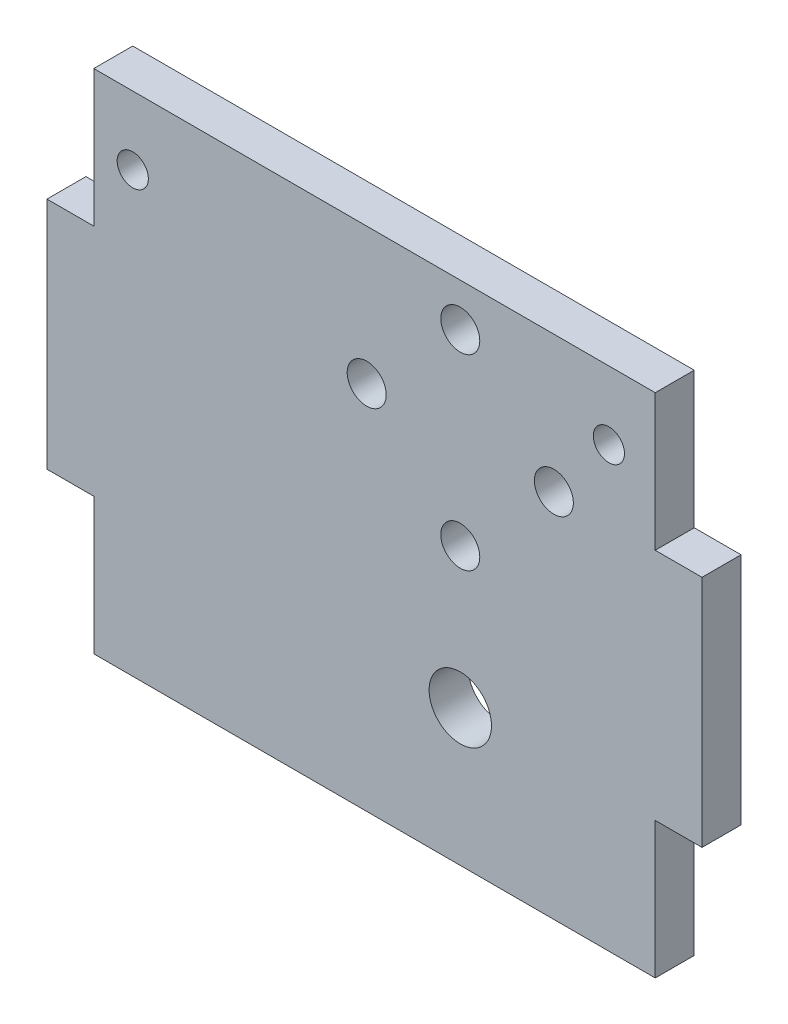
ISO-10303-21;
HEADER;
FILE_DESCRIPTION(('STEP AP214'),'2;1');
FILE_NAME('part.step','',(''),(''),'','','');
FILE_SCHEMA(('AUTOMOTIVE_DESIGN { 1 0 10303 214 1 1 1 1 }'));
ENDSEC;
DATA;
#1=APPLICATION_CONTEXT('core data for automotive mechanical design processes');
#2=APPLICATION_PROTOCOL_DEFINITION('international standard','automotive_design',2000,#1);
#3=PRODUCT_CONTEXT('',#1,'mechanical');
#4=PRODUCT('Part','Part','',(#3));
#5=PRODUCT_RELATED_PRODUCT_CATEGORY('part','',(#4));
#6=PRODUCT_DEFINITION_FORMATION('','',#4);
#7=PRODUCT_DEFINITION_CONTEXT('part definition',#1,'design');
#8=PRODUCT_DEFINITION('design','',#6,#7);
#9=PRODUCT_DEFINITION_SHAPE('','',#8);
#10=(LENGTH_UNIT() NAMED_UNIT(*) SI_UNIT(.MILLI.,.METRE.));
#11=(NAMED_UNIT(*) PLANE_ANGLE_UNIT() SI_UNIT($,.RADIAN.));
#12=(NAMED_UNIT(*) SI_UNIT($,.STERADIAN.) SOLID_ANGLE_UNIT());
#13=UNCERTAINTY_MEASURE_WITH_UNIT(LENGTH_MEASURE(1.E-05),#10,'distance_accuracy_value','');
#14=(GEOMETRIC_REPRESENTATION_CONTEXT(3) GLOBAL_UNCERTAINTY_ASSIGNED_CONTEXT((#13)) GLOBAL_UNIT_ASSIGNED_CONTEXT((#10,
#11,#12)) REPRESENTATION_CONTEXT('',''));
#15=CARTESIAN_POINT('',(0.,0.,0.));
#16=DIRECTION('',(0.,0.,1.));
#17=DIRECTION('',(1.,0.,0.));
#18=AXIS2_PLACEMENT_3D('',#15,#16,#17);
#19=CARTESIAN_POINT('',(50.,0.,5.));
#20=DIRECTION('',(-1.,0.,0.));
#21=DIRECTION('',(0.,0.,1.));
#22=AXIS2_PLACEMENT_3D('',#19,#20,#21);
#23=PLANE('',#22);
#24=DIRECTION('',(0.,0.,1.));
#25=VECTOR('',#24,1.);
#26=CARTESIAN_POINT('',(50.,47.5,-30.5941170815567));
#27=LINE('',#26,#25);
#28=CARTESIAN_POINT('',(50.,47.5,0.));
#29=VERTEX_POINT('',#28);
#30=CARTESIAN_POINT('',(50.,47.5,5.));
#31=VERTEX_POINT('',#30);
#32=EDGE_CURVE('E58',#29,#31,#27,.T.);
#33=ORIENTED_EDGE('',*,*,#32,.F.);
#34=DIRECTION('',(0.,1.,0.));
#35=VECTOR('',#34,1.);
#36=CARTESIAN_POINT('',(50.,0.,0.));
#37=LINE('',#36,#35);
#38=CARTESIAN_POINT('',(50.,65.,0.));
#39=VERTEX_POINT('',#38);
#40=EDGE_CURVE('E216',#29,#39,#37,.T.);
#41=ORIENTED_EDGE('',*,*,#40,.T.);
#42=DIRECTION('',(0.,0.,-1.));
#43=VECTOR('',#42,1.);
#44=CARTESIAN_POINT('',(50.,65.,5.));
#45=LINE('',#44,#43);
#46=CARTESIAN_POINT('',(50.,65.,5.));
#47=VERTEX_POINT('',#46);
#48=EDGE_CURVE('E42',#47,#39,#45,.T.);
#49=ORIENTED_EDGE('',*,*,#48,.F.);
#50=DIRECTION('',(0.,1.,0.));
#51=VECTOR('',#50,1.);
#52=CARTESIAN_POINT('',(50.,0.,5.));
#53=LINE('',#52,#51);
#54=EDGE_CURVE('E209',#31,#47,#53,.T.);
#55=ORIENTED_EDGE('',*,*,#54,.F.);
#56=EDGE_LOOP('',(#33,#41,#49,#55));
#57=FACE_BOUND('',#56,.T.);
#58=ADVANCED_FACE('F33',(#57),#23,.F.);
#59=CARTESIAN_POINT('',(-22.,65.,70.0076918525801));
#60=DIRECTION('',(-1.,0.,0.));
#61=DIRECTION('',(0.,0.,1.));
#62=AXIS2_PLACEMENT_3D('',#59,#60,#61);
#63=PLANE('',#62);
#64=DIRECTION('',(0.,1.,0.));
#65=VECTOR('',#64,1.);
#66=CARTESIAN_POINT('',(-22.,65.,0.));
#67=LINE('',#66,#65);
#68=CARTESIAN_POINT('',(-22.,47.5,0.));
#69=VERTEX_POINT('',#68);
#70=CARTESIAN_POINT('',(-22.,65.,0.));
#71=VERTEX_POINT('',#70);
#72=EDGE_CURVE('E176',#69,#71,#67,.T.);
#73=ORIENTED_EDGE('',*,*,#72,.F.);
#74=DIRECTION('',(0.,0.,1.));
#75=VECTOR('',#74,1.);
#76=CARTESIAN_POINT('',(-22.,47.5,-30.5941170815567));
#77=LINE('',#76,#75);
#78=CARTESIAN_POINT('',(-22.,47.5,5.));
#79=VERTEX_POINT('',#78);
#80=EDGE_CURVE('E172',#69,#79,#77,.T.);
#81=ORIENTED_EDGE('',*,*,#80,.T.);
#82=DIRECTION('',(0.,-1.,0.));
#83=VECTOR('',#82,1.);
#84=CARTESIAN_POINT('',(-22.,65.,5.));
#85=LINE('',#84,#83);
#86=CARTESIAN_POINT('',(-22.,65.,5.));
#87=VERTEX_POINT('',#86);
#88=EDGE_CURVE('E187',#87,#79,#85,.T.);
#89=ORIENTED_EDGE('',*,*,#88,.F.);
#90=DIRECTION('',(0.,0.,-1.));
#91=VECTOR('',#90,1.);
#92=CARTESIAN_POINT('',(-22.,65.,70.0076918525801));
#93=LINE('',#92,#91);
#94=EDGE_CURVE('E196',#87,#71,#93,.T.);
#95=ORIENTED_EDGE('',*,*,#94,.T.);
#96=EDGE_LOOP('',(#73,#81,#89,#95));
#97=FACE_BOUND('',#96,.T.);
#98=ADVANCED_FACE('F279',(#97),#63,.T.);
#99=CARTESIAN_POINT('',(0.,0.,5.));
#100=DIRECTION('',(0.,0.,-1.));
#101=DIRECTION('',(-1.,0.,0.));
#102=AXIS2_PLACEMENT_3D('',#99,#100,#101);
#103=PLANE('',#102);
#104=CARTESIAN_POINT('',(25.,59.5,5.));
#105=DIRECTION('',(0.,0.,1.));
#106=DIRECTION('',(1.,0.,0.));
#107=AXIS2_PLACEMENT_3D('',#104,#105,#106);
#108=CIRCLE('',#107,2.5);
#109=CARTESIAN_POINT('',(27.5,59.5,5.));
#110=VERTEX_POINT('',#109);
#111=EDGE_CURVE('E234',#110,#110,#108,.T.);
#112=ORIENTED_EDGE('',*,*,#111,.F.);
#113=EDGE_LOOP('',(#112));
#114=FACE_BOUND('',#113,.T.);
#115=CARTESIAN_POINT('',(25.,35.5,5.));
#116=DIRECTION('',(0.,0.,1.));
#117=DIRECTION('',(1.,0.,0.));
#118=AXIS2_PLACEMENT_3D('',#115,#116,#117);
#119=CIRCLE('',#118,2.5);
#120=CARTESIAN_POINT('',(27.5,35.5,5.));
#121=VERTEX_POINT('',#120);
#122=EDGE_CURVE('E505',#121,#121,#119,.T.);
#123=ORIENTED_EDGE('',*,*,#122,.F.);
#124=EDGE_LOOP('',(#123));
#125=FACE_BOUND('',#124,.T.);
#126=CARTESIAN_POINT('',(13.,47.5,5.));
#127=DIRECTION('',(0.,0.,1.));
#128=DIRECTION('',(1.,0.,0.));
#129=AXIS2_PLACEMENT_3D('',#126,#127,#128);
#130=CIRCLE('',#129,2.5);
#131=CARTESIAN_POINT('',(15.5,47.5,5.));
#132=VERTEX_POINT('',#131);
#133=EDGE_CURVE('E508',#132,#132,#130,.T.);
#134=ORIENTED_EDGE('',*,*,#133,.F.);
#135=EDGE_LOOP('',(#134));
#136=FACE_BOUND('',#135,.T.);
#137=CARTESIAN_POINT('',(37.,47.5,5.));
#138=DIRECTION('',(0.,0.,1.));
#139=DIRECTION('',(1.,0.,0.));
#140=AXIS2_PLACEMENT_3D('',#137,#138,#139);
#141=CIRCLE('',#140,2.5);
#142=CARTESIAN_POINT('',(39.5,47.5,5.));
#143=VERTEX_POINT('',#142);
#144=EDGE_CURVE('E512',#143,#143,#141,.T.);
#145=ORIENTED_EDGE('',*,*,#144,.F.);
#146=EDGE_LOOP('',(#145));
#147=FACE_BOUND('',#146,.T.);
#148=CARTESIAN_POINT('',(-17.,56.25,5.));
#149=DIRECTION('',(0.,0.,1.));
#150=DIRECTION('',(1.,0.,0.));
#151=AXIS2_PLACEMENT_3D('',#148,#149,#150);
#152=CIRCLE('',#151,2.);
#153=CARTESIAN_POINT('',(-15.,56.25,5.));
#154=VERTEX_POINT('',#153);
#155=EDGE_CURVE('E227',#154,#154,#152,.T.);
#156=ORIENTED_EDGE('',*,*,#155,.F.);
#157=EDGE_LOOP('',(#156));
#158=FACE_BOUND('',#157,.T.);
#159=CARTESIAN_POINT('',(44.0556394164773,56.25,5.));
#160=DIRECTION('',(0.,0.,1.));
#161=DIRECTION('',(1.,0.,0.));
#162=AXIS2_PLACEMENT_3D('',#159,#160,#161);
#163=CIRCLE('',#162,2.);
#164=CARTESIAN_POINT('',(46.0556394164773,56.25,5.));
#165=VERTEX_POINT('',#164);
#166=EDGE_CURVE('E241',#165,#165,#163,.T.);
#167=ORIENTED_EDGE('',*,*,#166,.F.);
#168=EDGE_LOOP('',(#167));
#169=FACE_BOUND('',#168,.T.);
#170=DIRECTION('',(-1.,0.,0.));
#171=VECTOR('',#170,1.);
#172=CARTESIAN_POINT('',(0.,65.,5.));
#173=LINE('',#172,#171);
#174=EDGE_CURVE('E213',#47,#87,#173,.T.);
#175=ORIENTED_EDGE('',*,*,#174,.T.);
#176=ORIENTED_EDGE('',*,*,#88,.T.);
#177=DIRECTION('',(1.,0.,0.));
#178=VECTOR('',#177,1.);
#179=CARTESIAN_POINT('',(0.,47.5,5.));
#180=LINE('',#179,#178);
#181=CARTESIAN_POINT('',(-28.,47.5,5.));
#182=VERTEX_POINT('',#181);
#183=EDGE_CURVE('E169',#182,#79,#180,.T.);
#184=ORIENTED_EDGE('',*,*,#183,.F.);
#185=DIRECTION('',(0.,1.,0.));
#186=VECTOR('',#185,1.);
#187=CARTESIAN_POINT('',(-28.,0.,5.));
#188=LINE('',#187,#186);
#189=CARTESIAN_POINT('',(-28.,17.5,5.));
#190=VERTEX_POINT('',#189);
#191=EDGE_CURVE('E165',#190,#182,#188,.T.);
#192=ORIENTED_EDGE('',*,*,#191,.F.);
#193=DIRECTION('',(-1.,0.,0.));
#194=VECTOR('',#193,1.);
#195=CARTESIAN_POINT('',(0.,17.5,5.));
#196=LINE('',#195,#194);
#197=CARTESIAN_POINT('',(-22.,17.5,5.));
#198=VERTEX_POINT('',#197);
#199=EDGE_CURVE('E160',#198,#190,#196,.T.);
#200=ORIENTED_EDGE('',*,*,#199,.F.);
#201=CARTESIAN_POINT('',(-22.,0.,5.));
#202=VERTEX_POINT('',#201);
#203=EDGE_CURVE('E191',#198,#202,#85,.T.);
#204=ORIENTED_EDGE('',*,*,#203,.T.);
#205=DIRECTION('',(1.,0.,0.));
#206=VECTOR('',#205,1.);
#207=CARTESIAN_POINT('',(0.,0.,5.));
#208=LINE('',#207,#206);
#209=CARTESIAN_POINT('',(50.,0.,5.));
#210=VERTEX_POINT('',#209);
#211=EDGE_CURVE('E207',#202,#210,#208,.T.);
#212=ORIENTED_EDGE('',*,*,#211,.T.);
#213=CARTESIAN_POINT('',(50.,17.5,5.));
#214=VERTEX_POINT('',#213);
#215=EDGE_CURVE('E211',#210,#214,#53,.T.);
#216=ORIENTED_EDGE('',*,*,#215,.T.);
#217=DIRECTION('',(1.,0.,0.));
#218=VECTOR('',#217,1.);
#219=CARTESIAN_POINT('',(0.,17.5,5.));
#220=LINE('',#219,#218);
#221=CARTESIAN_POINT('',(56.,17.5,5.));
#222=VERTEX_POINT('',#221);
#223=EDGE_CURVE('E153',#214,#222,#220,.T.);
#224=ORIENTED_EDGE('',*,*,#223,.T.);
#225=DIRECTION('',(0.,1.,0.));
#226=VECTOR('',#225,1.);
#227=CARTESIAN_POINT('',(56.,0.,5.));
#228=LINE('',#227,#226);
#229=CARTESIAN_POINT('',(56.,47.5,5.));
#230=VERTEX_POINT('',#229);
#231=EDGE_CURVE('E141',#222,#230,#228,.T.);
#232=ORIENTED_EDGE('',*,*,#231,.T.);
#233=DIRECTION('',(-1.,0.,0.));
#234=VECTOR('',#233,1.);
#235=CARTESIAN_POINT('',(0.,47.5,5.));
#236=LINE('',#235,#234);
#237=EDGE_CURVE('E147',#230,#31,#236,.T.);
#238=ORIENTED_EDGE('',*,*,#237,.T.);
#239=ORIENTED_EDGE('',*,*,#54,.T.);
#240=EDGE_LOOP('',(#175,#176,#184,#192,#200,#204,#212,#216,#224,#232,#238,#239));
#241=FACE_BOUND('',#240,.T.);
#242=CARTESIAN_POINT('',(25.,17.5,5.));
#243=DIRECTION('',(0.,0.,1.));
#244=DIRECTION('',(1.,0.,0.));
#245=AXIS2_PLACEMENT_3D('',#242,#243,#244);
#246=CIRCLE('',#245,4.);
#247=CARTESIAN_POINT('',(29.,17.5,5.));
#248=VERTEX_POINT('',#247);
#249=EDGE_CURVE('E201',#248,#248,#246,.T.);
#250=ORIENTED_EDGE('',*,*,#249,.F.);
#251=EDGE_LOOP('',(#250));
#252=FACE_BOUND('',#251,.T.);
#253=ADVANCED_FACE('F253',(#114,#125,#136,#147,#158,#169,#241,#252),#103,.F.);
#254=CARTESIAN_POINT('',(0.,0.,0.));
#255=DIRECTION('',(0.,0.,-1.));
#256=DIRECTION('',(-1.,0.,0.));
#257=AXIS2_PLACEMENT_3D('',#254,#255,#256);
#258=PLANE('',#257);
#259=CARTESIAN_POINT('',(25.,59.5,0.));
#260=DIRECTION('',(0.,0.,-1.));
#261=DIRECTION('',(-1.,0.,0.));
#262=AXIS2_PLACEMENT_3D('',#259,#260,#261);
#263=CIRCLE('',#262,2.5);
#264=CARTESIAN_POINT('',(22.5,59.5,0.));
#265=VERTEX_POINT('',#264);
#266=EDGE_CURVE('E37',#265,#265,#263,.T.);
#267=ORIENTED_EDGE('',*,*,#266,.F.);
#268=EDGE_LOOP('',(#267));
#269=FACE_BOUND('',#268,.T.);
#270=CARTESIAN_POINT('',(25.,35.5,0.));
#271=DIRECTION('',(0.,0.,-1.));
#272=DIRECTION('',(-1.,0.,0.));
#273=AXIS2_PLACEMENT_3D('',#270,#271,#272);
#274=CIRCLE('',#273,2.5);
#275=CARTESIAN_POINT('',(22.5,35.5,0.));
#276=VERTEX_POINT('',#275);
#277=EDGE_CURVE('E236',#276,#276,#274,.T.);
#278=ORIENTED_EDGE('',*,*,#277,.F.);
#279=EDGE_LOOP('',(#278));
#280=FACE_BOUND('',#279,.T.);
#281=CARTESIAN_POINT('',(13.,47.5,0.));
#282=DIRECTION('',(0.,0.,-1.));
#283=DIRECTION('',(-1.,0.,0.));
#284=AXIS2_PLACEMENT_3D('',#281,#282,#283);
#285=CIRCLE('',#284,2.5);
#286=CARTESIAN_POINT('',(10.5,47.5,0.));
#287=VERTEX_POINT('',#286);
#288=EDGE_CURVE('E233',#287,#287,#285,.T.);
#289=ORIENTED_EDGE('',*,*,#288,.F.);
#290=EDGE_LOOP('',(#289));
#291=FACE_BOUND('',#290,.T.);
#292=CARTESIAN_POINT('',(37.,47.5,0.));
#293=DIRECTION('',(0.,0.,-1.));
#294=DIRECTION('',(-1.,0.,0.));
#295=AXIS2_PLACEMENT_3D('',#292,#293,#294);
#296=CIRCLE('',#295,2.5);
#297=CARTESIAN_POINT('',(34.5,47.5,0.));
#298=VERTEX_POINT('',#297);
#299=EDGE_CURVE('E230',#298,#298,#296,.T.);
#300=ORIENTED_EDGE('',*,*,#299,.F.);
#301=EDGE_LOOP('',(#300));
#302=FACE_BOUND('',#301,.T.);
#303=CARTESIAN_POINT('',(-17.,56.25,0.));
#304=DIRECTION('',(0.,0.,-1.));
#305=DIRECTION('',(-1.,0.,0.));
#306=AXIS2_PLACEMENT_3D('',#303,#304,#305);
#307=CIRCLE('',#306,2.);
#308=CARTESIAN_POINT('',(-19.,56.25,0.));
#309=VERTEX_POINT('',#308);
#310=EDGE_CURVE('E226',#309,#309,#307,.T.);
#311=ORIENTED_EDGE('',*,*,#310,.F.);
#312=EDGE_LOOP('',(#311));
#313=FACE_BOUND('',#312,.T.);
#314=CARTESIAN_POINT('',(44.0556394164773,56.25,0.));
#315=DIRECTION('',(0.,0.,-1.));
#316=DIRECTION('',(-1.,0.,0.));
#317=AXIS2_PLACEMENT_3D('',#314,#315,#316);
#318=CIRCLE('',#317,2.);
#319=CARTESIAN_POINT('',(42.0556394164773,56.25,0.));
#320=VERTEX_POINT('',#319);
#321=EDGE_CURVE('E223',#320,#320,#318,.T.);
#322=ORIENTED_EDGE('',*,*,#321,.F.);
#323=EDGE_LOOP('',(#322));
#324=FACE_BOUND('',#323,.T.);
#325=CARTESIAN_POINT('',(25.,17.5,0.));
#326=DIRECTION('',(0.,0.,1.));
#327=DIRECTION('',(1.,0.,0.));
#328=AXIS2_PLACEMENT_3D('',#325,#326,#327);
#329=CIRCLE('',#328,4.);
#330=CARTESIAN_POINT('',(29.,17.5,0.));
#331=VERTEX_POINT('',#330);
#332=EDGE_CURVE('E190',#331,#331,#329,.T.);
#333=ORIENTED_EDGE('',*,*,#332,.T.);
#334=EDGE_LOOP('',(#333));
#335=FACE_BOUND('',#334,.T.);
#336=DIRECTION('',(1.,0.,0.));
#337=VECTOR('',#336,1.);
#338=CARTESIAN_POINT('',(0.,0.,0.));
#339=LINE('',#338,#337);
#340=CARTESIAN_POINT('',(-22.,0.,0.));
#341=VERTEX_POINT('',#340);
#342=CARTESIAN_POINT('',(50.,0.,0.));
#343=VERTEX_POINT('',#342);
#344=EDGE_CURVE('E204',#341,#343,#339,.T.);
#345=ORIENTED_EDGE('',*,*,#344,.F.);
#346=CARTESIAN_POINT('',(-22.,17.5,0.));
#347=VERTEX_POINT('',#346);
#348=EDGE_CURVE('E192',#341,#347,#67,.T.);
#349=ORIENTED_EDGE('',*,*,#348,.T.);
#350=DIRECTION('',(-1.,0.,0.));
#351=VECTOR('',#350,1.);
#352=CARTESIAN_POINT('',(0.,17.5,0.));
#353=LINE('',#352,#351);
#354=CARTESIAN_POINT('',(-28.,17.5,0.));
#355=VERTEX_POINT('',#354);
#356=EDGE_CURVE('E173',#347,#355,#353,.T.);
#357=ORIENTED_EDGE('',*,*,#356,.T.);
#358=DIRECTION('',(0.,1.,0.));
#359=VECTOR('',#358,1.);
#360=CARTESIAN_POINT('',(-28.,0.,0.));
#361=LINE('',#360,#359);
#362=CARTESIAN_POINT('',(-28.,47.5,0.));
#363=VERTEX_POINT('',#362);
#364=EDGE_CURVE('E168',#355,#363,#361,.T.);
#365=ORIENTED_EDGE('',*,*,#364,.T.);
#366=DIRECTION('',(1.,0.,0.));
#367=VECTOR('',#366,1.);
#368=CARTESIAN_POINT('',(0.,47.5,0.));
#369=LINE('',#368,#367);
#370=EDGE_CURVE('E177',#363,#69,#369,.T.);
#371=ORIENTED_EDGE('',*,*,#370,.T.);
#372=ORIENTED_EDGE('',*,*,#72,.T.);
#373=DIRECTION('',(-1.,0.,0.));
#374=VECTOR('',#373,1.);
#375=CARTESIAN_POINT('',(0.,65.,0.));
#376=LINE('',#375,#374);
#377=EDGE_CURVE('E210',#39,#71,#376,.T.);
#378=ORIENTED_EDGE('',*,*,#377,.F.);
#379=ORIENTED_EDGE('',*,*,#40,.F.);
#380=DIRECTION('',(-1.,0.,0.));
#381=VECTOR('',#380,1.);
#382=CARTESIAN_POINT('',(0.,47.5,0.));
#383=LINE('',#382,#381);
#384=CARTESIAN_POINT('',(56.,47.5,0.));
#385=VERTEX_POINT('',#384);
#386=EDGE_CURVE('E132',#385,#29,#383,.T.);
#387=ORIENTED_EDGE('',*,*,#386,.F.);
#388=DIRECTION('',(0.,1.,0.));
#389=VECTOR('',#388,1.);
#390=CARTESIAN_POINT('',(56.,0.,0.));
#391=LINE('',#390,#389);
#392=CARTESIAN_POINT('',(56.,17.5,0.));
#393=VERTEX_POINT('',#392);
#394=EDGE_CURVE('E125',#393,#385,#391,.T.);
#395=ORIENTED_EDGE('',*,*,#394,.F.);
#396=DIRECTION('',(1.,0.,0.));
#397=VECTOR('',#396,1.);
#398=CARTESIAN_POINT('',(0.,17.5,0.));
#399=LINE('',#398,#397);
#400=CARTESIAN_POINT('',(50.,17.5,0.));
#401=VERTEX_POINT('',#400);
#402=EDGE_CURVE('E130',#401,#393,#399,.T.);
#403=ORIENTED_EDGE('',*,*,#402,.F.);
#404=EDGE_CURVE('E217',#343,#401,#37,.T.);
#405=ORIENTED_EDGE('',*,*,#404,.F.);
#406=EDGE_LOOP('',(#345,#349,#357,#365,#371,#372,#378,#379,#387,#395,#403,#405));
#407=FACE_BOUND('',#406,.T.);
#408=ADVANCED_FACE('F127',(#269,#280,#291,#302,#313,#324,#335,#407),#258,.T.);
#409=CARTESIAN_POINT('',(0.,0.,5.));
#410=DIRECTION('',(0.,1.,0.));
#411=DIRECTION('',(0.,0.,1.));
#412=AXIS2_PLACEMENT_3D('',#409,#410,#411);
#413=PLANE('',#412);
#414=ORIENTED_EDGE('',*,*,#344,.T.);
#415=DIRECTION('',(0.,0.,-1.));
#416=VECTOR('',#415,1.);
#417=CARTESIAN_POINT('',(50.,0.,5.));
#418=LINE('',#417,#416);
#419=EDGE_CURVE('E11',#210,#343,#418,.T.);
#420=ORIENTED_EDGE('',*,*,#419,.F.);
#421=ORIENTED_EDGE('',*,*,#211,.F.);
#422=DIRECTION('',(0.,0.,-1.));
#423=VECTOR('',#422,1.);
#424=CARTESIAN_POINT('',(-22.,0.,70.0076918525801));
#425=LINE('',#424,#423);
#426=EDGE_CURVE('E195',#202,#341,#425,.T.);
#427=ORIENTED_EDGE('',*,*,#426,.T.);
#428=EDGE_LOOP('',(#414,#420,#421,#427));
#429=FACE_BOUND('',#428,.T.);
#430=ADVANCED_FACE('F35',(#429),#413,.F.);
#431=ORIENTED_EDGE('',*,*,#404,.T.);
#432=DIRECTION('',(0.,0.,1.));
#433=VECTOR('',#432,1.);
#434=CARTESIAN_POINT('',(50.,17.5,-30.5941170815567));
#435=LINE('',#434,#433);
#436=EDGE_CURVE('E50',#401,#214,#435,.T.);
#437=ORIENTED_EDGE('',*,*,#436,.T.);
#438=ORIENTED_EDGE('',*,*,#215,.F.);
#439=ORIENTED_EDGE('',*,*,#419,.T.);
#440=EDGE_LOOP('',(#431,#437,#438,#439));
#441=FACE_BOUND('',#440,.T.);
#442=ADVANCED_FACE('F257',(#441),#23,.F.);
#443=CARTESIAN_POINT('',(0.,65.,5.));
#444=DIRECTION('',(0.,-1.,0.));
#445=DIRECTION('',(0.,0.,-1.));
#446=AXIS2_PLACEMENT_3D('',#443,#444,#445);
#447=PLANE('',#446);
#448=ORIENTED_EDGE('',*,*,#377,.T.);
#449=ORIENTED_EDGE('',*,*,#94,.F.);
#450=ORIENTED_EDGE('',*,*,#174,.F.);
#451=ORIENTED_EDGE('',*,*,#48,.T.);
#452=EDGE_LOOP('',(#448,#449,#450,#451));
#453=FACE_BOUND('',#452,.T.);
#454=ADVANCED_FACE('F284',(#453),#447,.F.);
#455=CARTESIAN_POINT('',(25.,17.5,5.));
#456=DIRECTION('',(0.,0.,-1.));
#457=DIRECTION('',(-1.,0.,0.));
#458=AXIS2_PLACEMENT_3D('',#455,#456,#457);
#459=CYLINDRICAL_SURFACE('',#458,4.);
#460=ORIENTED_EDGE('',*,*,#249,.T.);
#461=EDGE_LOOP('',(#460));
#462=FACE_BOUND('',#461,.T.);
#463=ORIENTED_EDGE('',*,*,#332,.F.);
#464=EDGE_LOOP('',(#463));
#465=FACE_BOUND('',#464,.T.);
#466=ADVANCED_FACE('F310',(#462,#465),#459,.F.);
#467=DIRECTION('',(0.,0.,1.));
#468=VECTOR('',#467,1.);
#469=CARTESIAN_POINT('',(-22.,17.5,-30.5941170815567));
#470=LINE('',#469,#468);
#471=EDGE_CURVE('E164',#347,#198,#470,.T.);
#472=ORIENTED_EDGE('',*,*,#471,.F.);
#473=ORIENTED_EDGE('',*,*,#348,.F.);
#474=ORIENTED_EDGE('',*,*,#426,.F.);
#475=ORIENTED_EDGE('',*,*,#203,.F.);
#476=EDGE_LOOP('',(#472,#473,#474,#475));
#477=FACE_BOUND('',#476,.T.);
#478=ADVANCED_FACE('F263',(#477),#63,.T.);
#479=CARTESIAN_POINT('',(0.,47.5,-30.5941170815567));
#480=DIRECTION('',(0.,-1.,0.));
#481=DIRECTION('',(0.,0.,-1.));
#482=AXIS2_PLACEMENT_3D('',#479,#480,#481);
#483=PLANE('',#482);
#484=ORIENTED_EDGE('',*,*,#370,.F.);
#485=DIRECTION('',(0.,0.,1.));
#486=VECTOR('',#485,1.);
#487=CARTESIAN_POINT('',(-28.,47.5,-30.5941170815567));
#488=LINE('',#487,#486);
#489=EDGE_CURVE('E159',#363,#182,#488,.T.);
#490=ORIENTED_EDGE('',*,*,#489,.T.);
#491=ORIENTED_EDGE('',*,*,#183,.T.);
#492=ORIENTED_EDGE('',*,*,#80,.F.);
#493=EDGE_LOOP('',(#484,#490,#491,#492));
#494=FACE_BOUND('',#493,.T.);
#495=ADVANCED_FACE('F276',(#494),#483,.F.);
#496=CARTESIAN_POINT('',(0.,17.5,-30.5941170815567));
#497=DIRECTION('',(0.,1.,0.));
#498=DIRECTION('',(0.,0.,1.));
#499=AXIS2_PLACEMENT_3D('',#496,#497,#498);
#500=PLANE('',#499);
#501=ORIENTED_EDGE('',*,*,#356,.F.);
#502=ORIENTED_EDGE('',*,*,#471,.T.);
#503=ORIENTED_EDGE('',*,*,#199,.T.);
#504=DIRECTION('',(0.,0.,1.));
#505=VECTOR('',#504,1.);
#506=CARTESIAN_POINT('',(-28.,17.5,-30.5941170815567));
#507=LINE('',#506,#505);
#508=EDGE_CURVE('E163',#355,#190,#507,.T.);
#509=ORIENTED_EDGE('',*,*,#508,.F.);
#510=EDGE_LOOP('',(#501,#502,#503,#509));
#511=FACE_BOUND('',#510,.T.);
#512=ADVANCED_FACE('F266',(#511),#500,.F.);
#513=CARTESIAN_POINT('',(-28.,0.,-30.5941170815567));
#514=DIRECTION('',(1.,0.,0.));
#515=DIRECTION('',(0.,0.,-1.));
#516=AXIS2_PLACEMENT_3D('',#513,#514,#515);
#517=PLANE('',#516);
#518=ORIENTED_EDGE('',*,*,#364,.F.);
#519=ORIENTED_EDGE('',*,*,#508,.T.);
#520=ORIENTED_EDGE('',*,*,#191,.T.);
#521=ORIENTED_EDGE('',*,*,#489,.F.);
#522=EDGE_LOOP('',(#518,#519,#520,#521));
#523=FACE_BOUND('',#522,.T.);
#524=ADVANCED_FACE('F271',(#523),#517,.F.);
#525=CARTESIAN_POINT('',(0.,17.5,-30.5941170815567));
#526=DIRECTION('',(0.,-1.,0.));
#527=DIRECTION('',(0.,0.,-1.));
#528=AXIS2_PLACEMENT_3D('',#525,#526,#527);
#529=PLANE('',#528);
#530=ORIENTED_EDGE('',*,*,#436,.F.);
#531=ORIENTED_EDGE('',*,*,#402,.T.);
#532=DIRECTION('',(0.,0.,1.));
#533=VECTOR('',#532,1.);
#534=CARTESIAN_POINT('',(56.,17.5,-30.5941170815567));
#535=LINE('',#534,#533);
#536=EDGE_CURVE('E136',#393,#222,#535,.T.);
#537=ORIENTED_EDGE('',*,*,#536,.T.);
#538=ORIENTED_EDGE('',*,*,#223,.F.);
#539=EDGE_LOOP('',(#530,#531,#537,#538));
#540=FACE_BOUND('',#539,.T.);
#541=ADVANCED_FACE('F146',(#540),#529,.T.);
#542=CARTESIAN_POINT('',(56.,0.,-30.5941170815567));
#543=DIRECTION('',(1.,0.,0.));
#544=DIRECTION('',(0.,0.,-1.));
#545=AXIS2_PLACEMENT_3D('',#542,#543,#544);
#546=PLANE('',#545);
#547=ORIENTED_EDGE('',*,*,#536,.F.);
#548=ORIENTED_EDGE('',*,*,#394,.T.);
#549=DIRECTION('',(0.,0.,1.));
#550=VECTOR('',#549,1.);
#551=CARTESIAN_POINT('',(56.,47.5,-30.5941170815567));
#552=LINE('',#551,#550);
#553=EDGE_CURVE('E135',#385,#230,#552,.T.);
#554=ORIENTED_EDGE('',*,*,#553,.T.);
#555=ORIENTED_EDGE('',*,*,#231,.F.);
#556=EDGE_LOOP('',(#547,#548,#554,#555));
#557=FACE_BOUND('',#556,.T.);
#558=ADVANCED_FACE('F139',(#557),#546,.T.);
#559=CARTESIAN_POINT('',(0.,47.5,-30.5941170815567));
#560=DIRECTION('',(0.,1.,0.));
#561=DIRECTION('',(0.,0.,1.));
#562=AXIS2_PLACEMENT_3D('',#559,#560,#561);
#563=PLANE('',#562);
#564=ORIENTED_EDGE('',*,*,#553,.F.);
#565=ORIENTED_EDGE('',*,*,#386,.T.);
#566=ORIENTED_EDGE('',*,*,#32,.T.);
#567=ORIENTED_EDGE('',*,*,#237,.F.);
#568=EDGE_LOOP('',(#564,#565,#566,#567));
#569=FACE_BOUND('',#568,.T.);
#570=ADVANCED_FACE('F286',(#569),#563,.T.);
#571=CARTESIAN_POINT('',(44.0556394164773,56.25,-5.));
#572=DIRECTION('',(0.,0.,1.));
#573=DIRECTION('',(1.,0.,0.));
#574=AXIS2_PLACEMENT_3D('',#571,#572,#573);
#575=CYLINDRICAL_SURFACE('',#574,2.);
#576=ORIENTED_EDGE('',*,*,#321,.T.);
#577=EDGE_LOOP('',(#576));
#578=FACE_BOUND('',#577,.T.);
#579=ORIENTED_EDGE('',*,*,#166,.T.);
#580=EDGE_LOOP('',(#579));
#581=FACE_BOUND('',#580,.T.);
#582=ADVANCED_FACE('F288',(#578,#581),#575,.F.);
#583=CARTESIAN_POINT('',(-17.,56.25,-5.));
#584=DIRECTION('',(0.,0.,1.));
#585=DIRECTION('',(1.,0.,0.));
#586=AXIS2_PLACEMENT_3D('',#583,#584,#585);
#587=CYLINDRICAL_SURFACE('',#586,2.);
#588=ORIENTED_EDGE('',*,*,#310,.T.);
#589=EDGE_LOOP('',(#588));
#590=FACE_BOUND('',#589,.T.);
#591=ORIENTED_EDGE('',*,*,#155,.T.);
#592=EDGE_LOOP('',(#591));
#593=FACE_BOUND('',#592,.T.);
#594=ADVANCED_FACE('F294',(#590,#593),#587,.F.);
#595=CARTESIAN_POINT('',(37.,47.5,-5.));
#596=DIRECTION('',(0.,0.,1.));
#597=DIRECTION('',(1.,0.,0.));
#598=AXIS2_PLACEMENT_3D('',#595,#596,#597);
#599=CYLINDRICAL_SURFACE('',#598,2.5);
#600=ORIENTED_EDGE('',*,*,#299,.T.);
#601=EDGE_LOOP('',(#600));
#602=FACE_BOUND('',#601,.T.);
#603=ORIENTED_EDGE('',*,*,#144,.T.);
#604=EDGE_LOOP('',(#603));
#605=FACE_BOUND('',#604,.T.);
#606=ADVANCED_FACE('F361',(#602,#605),#599,.F.);
#607=CARTESIAN_POINT('',(13.,47.5,-5.));
#608=DIRECTION('',(0.,0.,1.));
#609=DIRECTION('',(1.,0.,0.));
#610=AXIS2_PLACEMENT_3D('',#607,#608,#609);
#611=CYLINDRICAL_SURFACE('',#610,2.5);
#612=ORIENTED_EDGE('',*,*,#288,.T.);
#613=EDGE_LOOP('',(#612));
#614=FACE_BOUND('',#613,.T.);
#615=ORIENTED_EDGE('',*,*,#133,.T.);
#616=EDGE_LOOP('',(#615));
#617=FACE_BOUND('',#616,.T.);
#618=ADVANCED_FACE('F470',(#614,#617),#611,.F.);
#619=CARTESIAN_POINT('',(25.,35.5,-5.));
#620=DIRECTION('',(0.,0.,1.));
#621=DIRECTION('',(1.,0.,0.));
#622=AXIS2_PLACEMENT_3D('',#619,#620,#621);
#623=CYLINDRICAL_SURFACE('',#622,2.5);
#624=ORIENTED_EDGE('',*,*,#277,.T.);
#625=EDGE_LOOP('',(#624));
#626=FACE_BOUND('',#625,.T.);
#627=ORIENTED_EDGE('',*,*,#122,.T.);
#628=EDGE_LOOP('',(#627));
#629=FACE_BOUND('',#628,.T.);
#630=ADVANCED_FACE('F477',(#626,#629),#623,.F.);
#631=CARTESIAN_POINT('',(25.,59.5,-5.));
#632=DIRECTION('',(0.,0.,1.));
#633=DIRECTION('',(1.,0.,0.));
#634=AXIS2_PLACEMENT_3D('',#631,#632,#633);
#635=CYLINDRICAL_SURFACE('',#634,2.5);
#636=ORIENTED_EDGE('',*,*,#266,.T.);
#637=EDGE_LOOP('',(#636));
#638=FACE_BOUND('',#637,.T.);
#639=ORIENTED_EDGE('',*,*,#111,.T.);
#640=EDGE_LOOP('',(#639));
#641=FACE_BOUND('',#640,.T.);
#642=ADVANCED_FACE('F485',(#638,#641),#635,.F.);
#643=CLOSED_SHELL('',(#58,#98,#253,#408,#430,#442,#454,#466,#478,#495,#512,#524,#541,#558,#570,
#582,#594,#606,#618,#630,#642));
#644=MANIFOLD_SOLID_BREP('B2',#643);
#645=ADVANCED_BREP_SHAPE_REPRESENTATION('',(#18,#644),#14);
#646=SHAPE_DEFINITION_REPRESENTATION(#9,#645);
ENDSEC;
END-ISO-10303-21;
